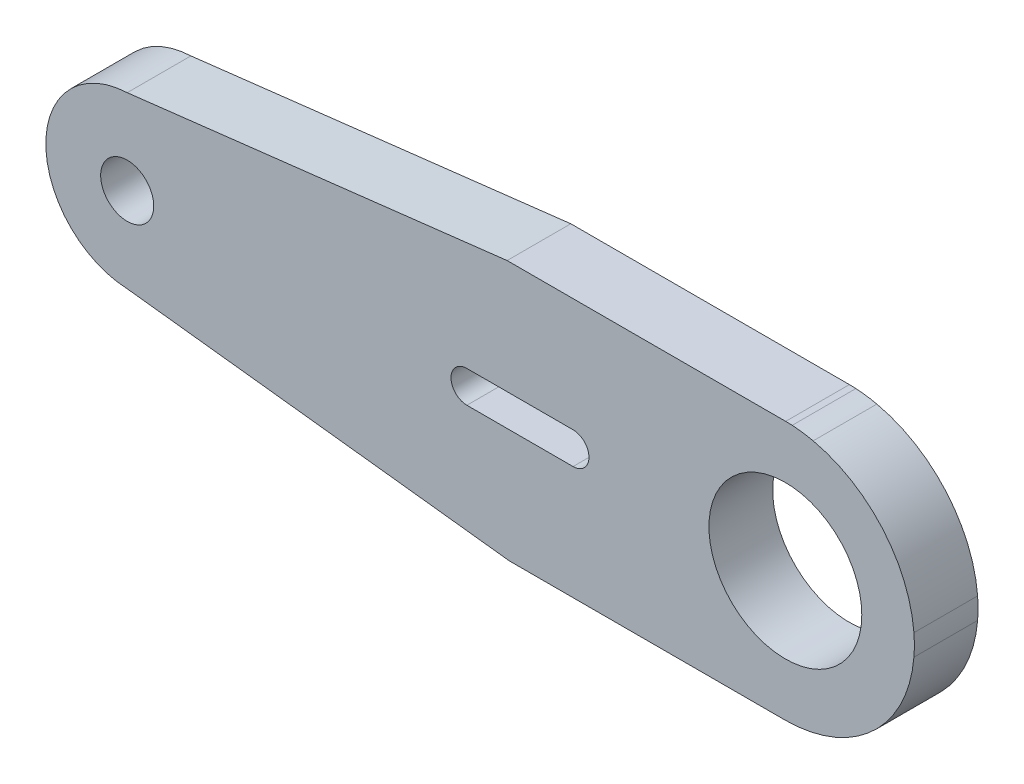
ISO-10303-21;
HEADER;
FILE_DESCRIPTION(('STEP AP214'),'2;1');
FILE_NAME('part.step','',(''),(''),'','','');
FILE_SCHEMA(('AUTOMOTIVE_DESIGN { 1 0 10303 214 1 1 1 1 }'));
ENDSEC;
DATA;
#1=APPLICATION_CONTEXT('core data for automotive mechanical design processes');
#2=APPLICATION_PROTOCOL_DEFINITION('international standard','automotive_design',2000,#1);
#3=PRODUCT_CONTEXT('',#1,'mechanical');
#4=PRODUCT('Part','Part','',(#3));
#5=PRODUCT_RELATED_PRODUCT_CATEGORY('part','',(#4));
#6=PRODUCT_DEFINITION_FORMATION('','',#4);
#7=PRODUCT_DEFINITION_CONTEXT('part definition',#1,'design');
#8=PRODUCT_DEFINITION('design','',#6,#7);
#9=PRODUCT_DEFINITION_SHAPE('','',#8);
#10=(LENGTH_UNIT() NAMED_UNIT(*) SI_UNIT(.MILLI.,.METRE.));
#11=(NAMED_UNIT(*) PLANE_ANGLE_UNIT() SI_UNIT($,.RADIAN.));
#12=(NAMED_UNIT(*) SI_UNIT($,.STERADIAN.) SOLID_ANGLE_UNIT());
#13=UNCERTAINTY_MEASURE_WITH_UNIT(LENGTH_MEASURE(1.E-05),#10,'distance_accuracy_value','');
#14=(GEOMETRIC_REPRESENTATION_CONTEXT(3) GLOBAL_UNCERTAINTY_ASSIGNED_CONTEXT((#13)) GLOBAL_UNIT_ASSIGNED_CONTEXT((#10,
#11,#12)) REPRESENTATION_CONTEXT('',''));
#15=CARTESIAN_POINT('',(0.,0.,0.));
#16=DIRECTION('',(0.,0.,1.));
#17=DIRECTION('',(1.,0.,0.));
#18=AXIS2_PLACEMENT_3D('',#15,#16,#17);
#19=CARTESIAN_POINT('',(2425.33996857822,1556.18845057078,3.));
#20=DIRECTION('',(0.,0.,-1.));
#21=DIRECTION('',(-1.,0.,0.));
#22=AXIS2_PLACEMENT_3D('',#19,#20,#21);
#23=CYLINDRICAL_SURFACE('',#22,6.09938036991776);
#24=CARTESIAN_POINT('',(2425.33996857822,1556.18845057078,0.));
#25=DIRECTION('',(0.,0.,1.));
#26=DIRECTION('',(1.,0.,0.));
#27=AXIS2_PLACEMENT_3D('',#24,#25,#26);
#28=CIRCLE('',#27,6.09938036991776);
#29=CARTESIAN_POINT('',(2426.67472444454,1562.13999387267,0.));
#30=VERTEX_POINT('',#29);
#31=CARTESIAN_POINT('',(2425.68542869963,1562.27803990024,0.));
#32=VERTEX_POINT('',#31);
#33=EDGE_CURVE('E206',#30,#32,#28,.T.);
#34=ORIENTED_EDGE('',*,*,#33,.T.);
#35=DIRECTION('',(0.,0.,-1.));
#36=VECTOR('',#35,1.);
#37=CARTESIAN_POINT('',(2425.68542869963,1562.27803990024,3.));
#38=LINE('',#37,#36);
#39=CARTESIAN_POINT('',(2425.68542869963,1562.27803990024,3.));
#40=VERTEX_POINT('',#39);
#41=EDGE_CURVE('E11',#40,#32,#38,.T.);
#42=ORIENTED_EDGE('',*,*,#41,.F.);
#43=CARTESIAN_POINT('',(2425.33996857822,1556.18845057078,3.));
#44=DIRECTION('',(0.,0.,1.));
#45=DIRECTION('',(1.,0.,0.));
#46=AXIS2_PLACEMENT_3D('',#43,#44,#45);
#47=CIRCLE('',#46,6.09938036991776);
#48=CARTESIAN_POINT('',(2426.67472444454,1562.13999387267,3.));
#49=VERTEX_POINT('',#48);
#50=EDGE_CURVE('E293',#49,#40,#47,.T.);
#51=ORIENTED_EDGE('',*,*,#50,.F.);
#52=DIRECTION('',(0.,0.,-1.));
#53=VECTOR('',#52,1.);
#54=CARTESIAN_POINT('',(2426.67472444454,1562.13999387267,3.));
#55=LINE('',#54,#53);
#56=EDGE_CURVE('E235',#49,#30,#55,.T.);
#57=ORIENTED_EDGE('',*,*,#56,.T.);
#58=EDGE_LOOP('',(#34,#42,#51,#57));
#59=FACE_BOUND('',#58,.T.);
#60=ADVANCED_FACE('F41',(#59),#23,.T.);
#61=CARTESIAN_POINT('',(2425.33982349252,1556.18741082578,3.));
#62=DIRECTION('',(0.,0.,-1.));
#63=DIRECTION('',(-1.,0.,0.));
#64=AXIS2_PLACEMENT_3D('',#61,#62,#63);
#65=CYLINDRICAL_SURFACE('',#64,6.10042666391895);
#66=CARTESIAN_POINT('',(2425.33982349252,1556.18741082578,0.));
#67=DIRECTION('',(0.,0.,1.));
#68=DIRECTION('',(1.,0.,0.));
#69=AXIS2_PLACEMENT_3D('',#66,#67,#68);
#70=CIRCLE('',#69,6.10042666391895);
#71=CARTESIAN_POINT('',(2425.38008449668,1562.28770463292,0.));
#72=VERTEX_POINT('',#71);
#73=EDGE_CURVE('E210',#32,#72,#70,.T.);
#74=ORIENTED_EDGE('',*,*,#73,.T.);
#75=DIRECTION('',(0.,0.,-1.));
#76=VECTOR('',#75,1.);
#77=CARTESIAN_POINT('',(2425.38008449668,1562.28770463292,3.));
#78=LINE('',#77,#76);
#79=CARTESIAN_POINT('',(2425.38008449668,1562.28770463292,3.));
#80=VERTEX_POINT('',#79);
#81=EDGE_CURVE('E52',#80,#72,#78,.T.);
#82=ORIENTED_EDGE('',*,*,#81,.F.);
#83=CARTESIAN_POINT('',(2425.33982349252,1556.18741082578,3.));
#84=DIRECTION('',(0.,0.,1.));
#85=DIRECTION('',(1.,0.,0.));
#86=AXIS2_PLACEMENT_3D('',#83,#84,#85);
#87=CIRCLE('',#86,6.10042666391895);
#88=EDGE_CURVE('E303',#40,#80,#87,.T.);
#89=ORIENTED_EDGE('',*,*,#88,.F.);
#90=ORIENTED_EDGE('',*,*,#41,.T.);
#91=EDGE_LOOP('',(#74,#82,#89,#90));
#92=FACE_BOUND('',#91,.T.);
#93=ADVANCED_FACE('F347',(#92),#65,.T.);
#94=CARTESIAN_POINT('',(-0.0796227058312107,1562.16408018961,3.));
#95=DIRECTION('',(5.0969489528988E-05,-0.999999998701055,0.));
#96=DIRECTION('',(0.999999998701056,5.0969489528988E-05,0.));
#97=AXIS2_PLACEMENT_3D('',#94,#95,#96);
#98=PLANE('',#97);
#99=DIRECTION('',(-0.999999998701056,-5.0969489528988E-05,0.));
#100=VECTOR('',#99,1.);
#101=CARTESIAN_POINT('',(-0.0796227058312107,1562.16408018961,0.));
#102=LINE('',#101,#100);
#103=CARTESIAN_POINT('',(2412.25909707203,1562.28703586288,0.));
#104=VERTEX_POINT('',#103);
#105=EDGE_CURVE('E213',#72,#104,#102,.T.);
#106=ORIENTED_EDGE('',*,*,#105,.T.);
#107=DIRECTION('',(0.,0.,-1.));
#108=VECTOR('',#107,1.);
#109=CARTESIAN_POINT('',(2412.25909707203,1562.28703586288,3.));
#110=LINE('',#109,#108);
#111=CARTESIAN_POINT('',(2412.25909707203,1562.28703586288,3.));
#112=VERTEX_POINT('',#111);
#113=EDGE_CURVE('E254',#112,#104,#110,.T.);
#114=ORIENTED_EDGE('',*,*,#113,.F.);
#115=DIRECTION('',(-0.999999998701056,-5.0969489528988E-05,0.));
#116=VECTOR('',#115,1.);
#117=CARTESIAN_POINT('',(-0.0796227058312107,1562.16408018961,3.));
#118=LINE('',#117,#116);
#119=EDGE_CURVE('E306',#80,#112,#118,.T.);
#120=ORIENTED_EDGE('',*,*,#119,.F.);
#121=ORIENTED_EDGE('',*,*,#81,.T.);
#122=EDGE_LOOP('',(#106,#114,#120,#121));
#123=FACE_BOUND('',#122,.T.);
#124=ADVANCED_FACE('F352',(#123),#98,.F.);
#125=CARTESIAN_POINT('',(-148.082953154036,1261.8119938318,3.));
#126=DIRECTION('',(0.116557468865907,-0.993183948949827,0.));
#127=DIRECTION('',(0.993183948949827,0.116557468865907,0.));
#128=AXIS2_PLACEMENT_3D('',#125,#126,#127);
#129=PLANE('',#128);
#130=DIRECTION('',(-0.993183948949827,-0.116557468865907,0.));
#131=VECTOR('',#130,1.);
#132=CARTESIAN_POINT('',(-148.082953154036,1261.8119938318,0.));
#133=LINE('',#132,#131);
#134=CARTESIAN_POINT('',(2394.36503748847,1560.18703586288,0.));
#135=VERTEX_POINT('',#134);
#136=EDGE_CURVE('E216',#104,#135,#133,.T.);
#137=ORIENTED_EDGE('',*,*,#136,.T.);
#138=DIRECTION('',(0.,0.,-1.));
#139=VECTOR('',#138,1.);
#140=CARTESIAN_POINT('',(2394.36503748847,1560.18703586288,3.));
#141=LINE('',#140,#139);
#142=CARTESIAN_POINT('',(2394.36503748847,1560.18703586288,3.));
#143=VERTEX_POINT('',#142);
#144=EDGE_CURVE('E250',#143,#135,#141,.T.);
#145=ORIENTED_EDGE('',*,*,#144,.F.);
#146=DIRECTION('',(-0.993183948949827,-0.116557468865907,0.));
#147=VECTOR('',#146,1.);
#148=CARTESIAN_POINT('',(-148.082953154036,1261.8119938318,3.));
#149=LINE('',#148,#147);
#150=EDGE_CURVE('E309',#112,#143,#149,.T.);
#151=ORIENTED_EDGE('',*,*,#150,.F.);
#152=ORIENTED_EDGE('',*,*,#113,.T.);
#153=EDGE_LOOP('',(#137,#145,#151,#152));
#154=FACE_BOUND('',#153,.T.);
#155=ADVANCED_FACE('F465',(#154),#129,.F.);
#156=CARTESIAN_POINT('',(2394.53674225824,1556.18703586288,3.));
#157=DIRECTION('',(0.,0.,-1.));
#158=DIRECTION('',(-1.,0.,0.));
#159=AXIS2_PLACEMENT_3D('',#156,#157,#158);
#160=CYLINDRICAL_SURFACE('',#159,4.00368361986295);
#161=CARTESIAN_POINT('',(2394.53674225824,1556.18703586288,0.));
#162=DIRECTION('',(0.,0.,1.));
#163=DIRECTION('',(1.,0.,0.));
#164=AXIS2_PLACEMENT_3D('',#161,#162,#163);
#165=CIRCLE('',#164,4.00368361986295);
#166=CARTESIAN_POINT('',(2394.36503748848,1552.18703586288,0.));
#167=VERTEX_POINT('',#166);
#168=EDGE_CURVE('E219',#135,#167,#165,.T.);
#169=ORIENTED_EDGE('',*,*,#168,.T.);
#170=DIRECTION('',(0.,0.,-1.));
#171=VECTOR('',#170,1.);
#172=CARTESIAN_POINT('',(2394.36503748848,1552.18703586288,3.));
#173=LINE('',#172,#171);
#174=CARTESIAN_POINT('',(2394.36503748848,1552.18703586288,3.));
#175=VERTEX_POINT('',#174);
#176=EDGE_CURVE('E246',#175,#167,#173,.T.);
#177=ORIENTED_EDGE('',*,*,#176,.F.);
#178=CARTESIAN_POINT('',(2394.53674225824,1556.18703586288,3.));
#179=DIRECTION('',(0.,0.,1.));
#180=DIRECTION('',(1.,0.,0.));
#181=AXIS2_PLACEMENT_3D('',#178,#179,#180);
#182=CIRCLE('',#181,4.00368361986295);
#183=EDGE_CURVE('E312',#143,#175,#182,.T.);
#184=ORIENTED_EDGE('',*,*,#183,.F.);
#185=ORIENTED_EDGE('',*,*,#144,.T.);
#186=EDGE_LOOP('',(#169,#177,#184,#185));
#187=FACE_BOUND('',#186,.T.);
#188=ADVANCED_FACE('F455',(#187),#160,.T.);
#189=CARTESIAN_POINT('',(210.810406910163,1806.93646851023,3.));
#190=DIRECTION('',(0.115881324440692,0.993263066184317,0.));
#191=DIRECTION('',(-0.993263066184317,0.115881324440692,0.));
#192=AXIS2_PLACEMENT_3D('',#189,#190,#191);
#193=PLANE('',#192);
#194=DIRECTION('',(0.993263066184317,-0.115881324440692,0.));
#195=VECTOR('',#194,1.);
#196=CARTESIAN_POINT('',(210.810406910163,1806.93646851023,0.));
#197=LINE('',#196,#195);
#198=CARTESIAN_POINT('',(2412.36493910381,1550.08703586288,0.));
#199=VERTEX_POINT('',#198);
#200=EDGE_CURVE('E222',#167,#199,#197,.T.);
#201=ORIENTED_EDGE('',*,*,#200,.T.);
#202=DIRECTION('',(0.,0.,-1.));
#203=VECTOR('',#202,1.);
#204=CARTESIAN_POINT('',(2412.36493910381,1550.08703586288,3.));
#205=LINE('',#204,#203);
#206=CARTESIAN_POINT('',(2412.36493910381,1550.08703586288,3.));
#207=VERTEX_POINT('',#206);
#208=EDGE_CURVE('E242',#207,#199,#205,.T.);
#209=ORIENTED_EDGE('',*,*,#208,.F.);
#210=DIRECTION('',(0.993263066184317,-0.115881324440692,0.));
#211=VECTOR('',#210,1.);
#212=CARTESIAN_POINT('',(210.810406910163,1806.93646851023,3.));
#213=LINE('',#212,#211);
#214=EDGE_CURVE('E315',#175,#207,#213,.T.);
#215=ORIENTED_EDGE('',*,*,#214,.F.);
#216=ORIENTED_EDGE('',*,*,#176,.T.);
#217=EDGE_LOOP('',(#201,#209,#215,#216));
#218=FACE_BOUND('',#217,.T.);
#219=ADVANCED_FACE('F323',(#218),#193,.F.);
#220=CARTESIAN_POINT('',(0.,1550.08703586288,3.));
#221=DIRECTION('',(0.,1.,0.));
#222=DIRECTION('',(0.,0.,1.));
#223=AXIS2_PLACEMENT_3D('',#220,#221,#222);
#224=PLANE('',#223);
#225=DIRECTION('',(1.,0.,0.));
#226=VECTOR('',#225,1.);
#227=CARTESIAN_POINT('',(0.,1550.08703586288,0.));
#228=LINE('',#227,#226);
#229=CARTESIAN_POINT('',(2425.3649391039,1550.08703586288,0.));
#230=VERTEX_POINT('',#229);
#231=EDGE_CURVE('E225',#199,#230,#228,.T.);
#232=ORIENTED_EDGE('',*,*,#231,.T.);
#233=DIRECTION('',(0.,0.,-1.));
#234=VECTOR('',#233,1.);
#235=CARTESIAN_POINT('',(2425.3649391039,1550.08703586288,3.));
#236=LINE('',#235,#234);
#237=CARTESIAN_POINT('',(2425.3649391039,1550.08703586288,3.));
#238=VERTEX_POINT('',#237);
#239=EDGE_CURVE('E171',#238,#230,#236,.T.);
#240=ORIENTED_EDGE('',*,*,#239,.F.);
#241=DIRECTION('',(1.,0.,0.));
#242=VECTOR('',#241,1.);
#243=CARTESIAN_POINT('',(0.,1550.08703586288,3.));
#244=LINE('',#243,#242);
#245=EDGE_CURVE('E160',#207,#238,#244,.T.);
#246=ORIENTED_EDGE('',*,*,#245,.F.);
#247=ORIENTED_EDGE('',*,*,#208,.T.);
#248=EDGE_LOOP('',(#232,#240,#246,#247));
#249=FACE_BOUND('',#248,.T.);
#250=ADVANCED_FACE('F327',(#249),#224,.F.);
#251=CARTESIAN_POINT('',(2425.33982349252,1556.18741082578,3.));
#252=DIRECTION('',(0.,0.,-1.));
#253=DIRECTION('',(-1.,0.,0.));
#254=AXIS2_PLACEMENT_3D('',#251,#252,#253);
#255=CYLINDRICAL_SURFACE('',#254,6.10042666391874);
#256=CARTESIAN_POINT('',(2425.33982349252,1556.18741082578,0.));
#257=DIRECTION('',(0.,0.,1.));
#258=DIRECTION('',(1.,0.,0.));
#259=AXIS2_PLACEMENT_3D('',#256,#257,#258);
#260=CIRCLE('',#259,6.10042666391874);
#261=CARTESIAN_POINT('',(2431.41977125444,1555.6879704448,0.));
#262=VERTEX_POINT('',#261);
#263=EDGE_CURVE('E169',#230,#262,#260,.T.);
#264=ORIENTED_EDGE('',*,*,#263,.T.);
#265=DIRECTION('',(0.,0.,-1.));
#266=VECTOR('',#265,1.);
#267=CARTESIAN_POINT('',(2431.41977125444,1555.6879704448,3.));
#268=LINE('',#267,#266);
#269=CARTESIAN_POINT('',(2431.41977125444,1555.6879704448,3.));
#270=VERTEX_POINT('',#269);
#271=EDGE_CURVE('E166',#270,#262,#268,.T.);
#272=ORIENTED_EDGE('',*,*,#271,.F.);
#273=CARTESIAN_POINT('',(2425.33982349252,1556.18741082578,3.));
#274=DIRECTION('',(0.,0.,1.));
#275=DIRECTION('',(1.,0.,0.));
#276=AXIS2_PLACEMENT_3D('',#273,#274,#275);
#277=CIRCLE('',#276,6.10042666391874);
#278=EDGE_CURVE('E154',#238,#270,#277,.T.);
#279=ORIENTED_EDGE('',*,*,#278,.F.);
#280=ORIENTED_EDGE('',*,*,#239,.T.);
#281=EDGE_LOOP('',(#264,#272,#279,#280));
#282=FACE_BOUND('',#281,.T.);
#283=ADVANCED_FACE('F167',(#282),#255,.T.);
#284=CARTESIAN_POINT('',(2425.36490256972,1556.18741082578,3.));
#285=DIRECTION('',(0.,0.,-1.));
#286=DIRECTION('',(-1.,0.,0.));
#287=AXIS2_PLACEMENT_3D('',#284,#285,#286);
#288=CYLINDRICAL_SURFACE('',#287,6.07543212317653);
#289=CARTESIAN_POINT('',(2425.36490256972,1556.18741082578,0.));
#290=DIRECTION('',(0.,0.,1.));
#291=DIRECTION('',(1.,0.,0.));
#292=AXIS2_PLACEMENT_3D('',#289,#290,#291);
#293=CIRCLE('',#292,6.07543212317653);
#294=CARTESIAN_POINT('',(2431.41977125444,1556.68685120676,0.));
#295=VERTEX_POINT('',#294);
#296=EDGE_CURVE('E108',#262,#295,#293,.T.);
#297=ORIENTED_EDGE('',*,*,#296,.T.);
#298=DIRECTION('',(0.,0.,-1.));
#299=VECTOR('',#298,1.);
#300=CARTESIAN_POINT('',(2431.41977125444,1556.68685120676,3.));
#301=LINE('',#300,#299);
#302=CARTESIAN_POINT('',(2431.41977125444,1556.68685120676,3.));
#303=VERTEX_POINT('',#302);
#304=EDGE_CURVE('E172',#303,#295,#301,.T.);
#305=ORIENTED_EDGE('',*,*,#304,.F.);
#306=CARTESIAN_POINT('',(2425.36490256972,1556.18741082578,3.));
#307=DIRECTION('',(0.,0.,1.));
#308=DIRECTION('',(1.,0.,0.));
#309=AXIS2_PLACEMENT_3D('',#306,#307,#308);
#310=CIRCLE('',#309,6.07543212317653);
#311=EDGE_CURVE('E158',#270,#303,#310,.T.);
#312=ORIENTED_EDGE('',*,*,#311,.F.);
#313=ORIENTED_EDGE('',*,*,#271,.T.);
#314=EDGE_LOOP('',(#297,#305,#312,#313));
#315=FACE_BOUND('',#314,.T.);
#316=ADVANCED_FACE('F174',(#315),#288,.T.);
#317=CARTESIAN_POINT('',(2410.36490479031,1556.18703586288,3.));
#318=DIRECTION('',(0.,0.,-1.));
#319=DIRECTION('',(-1.,0.,0.));
#320=AXIS2_PLACEMENT_3D('',#317,#318,#319);
#321=CYLINDRICAL_SURFACE('',#320,0.750000000000241);
#322=CARTESIAN_POINT('',(2410.36490479031,1556.18703586288,0.));
#323=DIRECTION('',(0.,0.,1.));
#324=DIRECTION('',(1.,0.,0.));
#325=AXIS2_PLACEMENT_3D('',#322,#323,#324);
#326=CIRCLE('',#325,0.750000000000241);
#327=CARTESIAN_POINT('',(2410.36496073506,1556.9370358608,0.));
#328=VERTEX_POINT('',#327);
#329=CARTESIAN_POINT('',(2410.36496073506,1555.43703586497,0.));
#330=VERTEX_POINT('',#329);
#331=EDGE_CURVE('E190',#328,#330,#326,.T.);
#332=ORIENTED_EDGE('',*,*,#331,.F.);
#333=DIRECTION('',(0.,0.,-1.));
#334=VECTOR('',#333,1.);
#335=CARTESIAN_POINT('',(2410.36496073506,1556.9370358608,3.));
#336=LINE('',#335,#334);
#337=CARTESIAN_POINT('',(2410.36496073506,1556.9370358608,3.));
#338=VERTEX_POINT('',#337);
#339=EDGE_CURVE('E45',#338,#328,#336,.T.);
#340=ORIENTED_EDGE('',*,*,#339,.F.);
#341=CARTESIAN_POINT('',(2410.36490479031,1556.18703586288,3.));
#342=DIRECTION('',(0.,0.,1.));
#343=DIRECTION('',(1.,0.,0.));
#344=AXIS2_PLACEMENT_3D('',#341,#342,#343);
#345=CIRCLE('',#344,0.750000000000241);
#346=CARTESIAN_POINT('',(2410.36496073506,1555.43703586497,3.));
#347=VERTEX_POINT('',#346);
#348=EDGE_CURVE('E283',#338,#347,#345,.T.);
#349=ORIENTED_EDGE('',*,*,#348,.T.);
#350=DIRECTION('',(0.,0.,-1.));
#351=VECTOR('',#350,1.);
#352=CARTESIAN_POINT('',(2410.36496073506,1555.43703586497,3.));
#353=LINE('',#352,#351);
#354=EDGE_CURVE('E178',#347,#330,#353,.T.);
#355=ORIENTED_EDGE('',*,*,#354,.T.);
#356=EDGE_LOOP('',(#332,#340,#349,#355));
#357=FACE_BOUND('',#356,.T.);
#358=ADVANCED_FACE('F281',(#357),#321,.F.);
#359=CARTESIAN_POINT('',(5.18219152778422E-07,1556.93703666308,3.));
#360=DIRECTION('',(3.32845285695754E-10,1.,0.));
#361=DIRECTION('',(-1.,3.32845285695754E-10,0.));
#362=AXIS2_PLACEMENT_3D('',#359,#360,#361);
#363=PLANE('',#362);
#364=DIRECTION('',(1.,-3.32845285695754E-10,0.));
#365=VECTOR('',#364,1.);
#366=CARTESIAN_POINT('',(5.18219152778422E-07,1556.93703666308,0.));
#367=LINE('',#366,#365);
#368=CARTESIAN_POINT('',(2415.36495438206,1556.93703585913,0.));
#369=VERTEX_POINT('',#368);
#370=EDGE_CURVE('E194',#328,#369,#367,.T.);
#371=ORIENTED_EDGE('',*,*,#370,.T.);
#372=DIRECTION('',(0.,0.,-1.));
#373=VECTOR('',#372,1.);
#374=CARTESIAN_POINT('',(2415.36495438206,1556.93703585913,3.));
#375=LINE('',#374,#373);
#376=CARTESIAN_POINT('',(2415.36495438206,1556.93703585913,3.));
#377=VERTEX_POINT('',#376);
#378=EDGE_CURVE('E265',#377,#369,#375,.T.);
#379=ORIENTED_EDGE('',*,*,#378,.F.);
#380=DIRECTION('',(1.,-3.32845285695754E-10,0.));
#381=VECTOR('',#380,1.);
#382=CARTESIAN_POINT('',(5.18219152778422E-07,1556.93703666308,3.));
#383=LINE('',#382,#381);
#384=EDGE_CURVE('E275',#338,#377,#383,.T.);
#385=ORIENTED_EDGE('',*,*,#384,.F.);
#386=ORIENTED_EDGE('',*,*,#339,.T.);
#387=EDGE_LOOP('',(#371,#379,#385,#386));
#388=FACE_BOUND('',#387,.T.);
#389=ADVANCED_FACE('F274',(#388),#363,.F.);
#390=CARTESIAN_POINT('',(2415.36487937831,1556.18703586288,3.));
#391=DIRECTION('',(0.,0.,-1.));
#392=DIRECTION('',(-1.,0.,0.));
#393=AXIS2_PLACEMENT_3D('',#390,#391,#392);
#394=CYLINDRICAL_SURFACE('',#393,0.750000000000403);
#395=CARTESIAN_POINT('',(2415.36487937831,1556.18703586288,0.));
#396=DIRECTION('',(0.,0.,1.));
#397=DIRECTION('',(1.,0.,0.));
#398=AXIS2_PLACEMENT_3D('',#395,#396,#397);
#399=CIRCLE('',#398,0.750000000000403);
#400=CARTESIAN_POINT('',(2415.36495438206,1555.43703586663,0.));
#401=VERTEX_POINT('',#400);
#402=EDGE_CURVE('E198',#401,#369,#399,.T.);
#403=ORIENTED_EDGE('',*,*,#402,.F.);
#404=DIRECTION('',(0.,0.,-1.));
#405=VECTOR('',#404,1.);
#406=CARTESIAN_POINT('',(2415.36495438206,1555.43703586663,3.));
#407=LINE('',#406,#405);
#408=CARTESIAN_POINT('',(2415.36495438206,1555.43703586663,3.));
#409=VERTEX_POINT('',#408);
#410=EDGE_CURVE('E263',#409,#401,#407,.T.);
#411=ORIENTED_EDGE('',*,*,#410,.F.);
#412=CARTESIAN_POINT('',(2415.36487937831,1556.18703586288,3.));
#413=DIRECTION('',(0.,0.,1.));
#414=DIRECTION('',(1.,0.,0.));
#415=AXIS2_PLACEMENT_3D('',#412,#413,#414);
#416=CIRCLE('',#415,0.750000000000403);
#417=EDGE_CURVE('E289',#409,#377,#416,.T.);
#418=ORIENTED_EDGE('',*,*,#417,.T.);
#419=ORIENTED_EDGE('',*,*,#378,.T.);
#420=EDGE_LOOP('',(#403,#411,#418,#419));
#421=FACE_BOUND('',#420,.T.);
#422=ADVANCED_FACE('F287',(#421),#394,.F.);
#423=CARTESIAN_POINT('',(-5.17374507476788E-07,1555.43703506323,3.));
#424=DIRECTION('',(3.32623240808817E-10,-1.,0.));
#425=DIRECTION('',(1.,3.32623240808817E-10,0.));
#426=AXIS2_PLACEMENT_3D('',#423,#424,#425);
#427=PLANE('',#426);
#428=DIRECTION('',(-1.,-3.32623240808817E-10,0.));
#429=VECTOR('',#428,1.);
#430=CARTESIAN_POINT('',(-5.17374507476788E-07,1555.43703506323,0.));
#431=LINE('',#430,#429);
#432=EDGE_CURVE('E202',#401,#330,#431,.T.);
#433=ORIENTED_EDGE('',*,*,#432,.T.);
#434=ORIENTED_EDGE('',*,*,#354,.F.);
#435=DIRECTION('',(-1.,-3.32623240808817E-10,0.));
#436=VECTOR('',#435,1.);
#437=CARTESIAN_POINT('',(-5.17374507476788E-07,1555.43703506323,3.));
#438=LINE('',#437,#436);
#439=EDGE_CURVE('E290',#409,#347,#438,.T.);
#440=ORIENTED_EDGE('',*,*,#439,.F.);
#441=ORIENTED_EDGE('',*,*,#410,.T.);
#442=EDGE_LOOP('',(#433,#434,#440,#441));
#443=FACE_BOUND('',#442,.T.);
#444=ADVANCED_FACE('F286',(#443),#427,.F.);
#445=CARTESIAN_POINT('',(2394.36503748848,1556.18703586288,3.));
#446=DIRECTION('',(0.,0.,-1.));
#447=DIRECTION('',(-1.,0.,0.));
#448=AXIS2_PLACEMENT_3D('',#445,#446,#447);
#449=CYLINDRICAL_SURFACE('',#448,1.25000000000008);
#450=CARTESIAN_POINT('',(2394.36503748848,1556.18703586288,3.));
#451=DIRECTION('',(0.,0.,1.));
#452=DIRECTION('',(1.,0.,0.));
#453=AXIS2_PLACEMENT_3D('',#450,#451,#452);
#454=CIRCLE('',#453,1.25000000000008);
#455=CARTESIAN_POINT('',(2395.61503748848,1556.18703586288,3.));
#456=VERTEX_POINT('',#455);
#457=EDGE_CURVE('E371',#456,#456,#454,.T.);
#458=ORIENTED_EDGE('',*,*,#457,.T.);
#459=EDGE_LOOP('',(#458));
#460=FACE_BOUND('',#459,.T.);
#461=CARTESIAN_POINT('',(2394.36503748848,1556.18703586288,0.));
#462=DIRECTION('',(0.,0.,1.));
#463=DIRECTION('',(1.,0.,0.));
#464=AXIS2_PLACEMENT_3D('',#461,#462,#463);
#465=CIRCLE('',#464,1.25000000000008);
#466=CARTESIAN_POINT('',(2395.61503748848,1556.18703586288,0.));
#467=VERTEX_POINT('',#466);
#468=EDGE_CURVE('E186',#467,#467,#465,.T.);
#469=ORIENTED_EDGE('',*,*,#468,.F.);
#470=EDGE_LOOP('',(#469));
#471=FACE_BOUND('',#470,.T.);
#472=ADVANCED_FACE('F342',(#460,#471),#449,.F.);
#473=CARTESIAN_POINT('',(2425.36492938331,1556.18708586288,3.));
#474=DIRECTION('',(0.,0.,-1.));
#475=DIRECTION('',(-1.,0.,0.));
#476=AXIS2_PLACEMENT_3D('',#473,#474,#475);
#477=CYLINDRICAL_SURFACE('',#476,3.60000000000003);
#478=CARTESIAN_POINT('',(2425.36492938331,1556.18708586288,3.));
#479=DIRECTION('',(0.,0.,1.));
#480=DIRECTION('',(1.,0.,0.));
#481=AXIS2_PLACEMENT_3D('',#478,#479,#480);
#482=CIRCLE('',#481,3.60000000000003);
#483=CARTESIAN_POINT('',(2428.96492938331,1556.18708586288,3.));
#484=VERTEX_POINT('',#483);
#485=EDGE_CURVE('E234',#484,#484,#482,.T.);
#486=ORIENTED_EDGE('',*,*,#485,.T.);
#487=EDGE_LOOP('',(#486));
#488=FACE_BOUND('',#487,.T.);
#489=CARTESIAN_POINT('',(2425.36492938331,1556.18708586288,0.));
#490=DIRECTION('',(0.,0.,1.));
#491=DIRECTION('',(1.,0.,0.));
#492=AXIS2_PLACEMENT_3D('',#489,#490,#491);
#493=CIRCLE('',#492,3.60000000000003);
#494=CARTESIAN_POINT('',(2428.96492938331,1556.18708586288,0.));
#495=VERTEX_POINT('',#494);
#496=EDGE_CURVE('E182',#495,#495,#493,.T.);
#497=ORIENTED_EDGE('',*,*,#496,.F.);
#498=EDGE_LOOP('',(#497));
#499=FACE_BOUND('',#498,.T.);
#500=ADVANCED_FACE('F43',(#488,#499),#477,.F.);
#501=CARTESIAN_POINT('',(2425.33982349252,1556.18741082578,3.));
#502=DIRECTION('',(0.,0.,-1.));
#503=DIRECTION('',(-1.,0.,0.));
#504=AXIS2_PLACEMENT_3D('',#501,#502,#503);
#505=CYLINDRICAL_SURFACE('',#504,6.10042666391856);
#506=CARTESIAN_POINT('',(2425.33982349252,1556.18741082578,0.));
#507=DIRECTION('',(0.,0.,1.));
#508=DIRECTION('',(1.,0.,0.));
#509=AXIS2_PLACEMENT_3D('',#506,#507,#508);
#510=CIRCLE('',#509,6.10042666391856);
#511=EDGE_CURVE('E114',#295,#30,#510,.T.);
#512=ORIENTED_EDGE('',*,*,#511,.T.);
#513=ORIENTED_EDGE('',*,*,#56,.F.);
#514=CARTESIAN_POINT('',(2425.33982349252,1556.18741082578,3.));
#515=DIRECTION('',(0.,0.,1.));
#516=DIRECTION('',(1.,0.,0.));
#517=AXIS2_PLACEMENT_3D('',#514,#515,#516);
#518=CIRCLE('',#517,6.10042666391856);
#519=EDGE_CURVE('E61',#303,#49,#518,.T.);
#520=ORIENTED_EDGE('',*,*,#519,.F.);
#521=ORIENTED_EDGE('',*,*,#304,.T.);
#522=EDGE_LOOP('',(#512,#513,#520,#521));
#523=FACE_BOUND('',#522,.T.);
#524=ADVANCED_FACE('F333',(#523),#505,.T.);
#525=CARTESIAN_POINT('',(0.,0.,3.));
#526=DIRECTION('',(0.,0.,1.));
#527=DIRECTION('',(1.,0.,0.));
#528=AXIS2_PLACEMENT_3D('',#525,#526,#527);
#529=PLANE('',#528);
#530=ORIENTED_EDGE('',*,*,#485,.F.);
#531=EDGE_LOOP('',(#530));
#532=FACE_BOUND('',#531,.T.);
#533=ORIENTED_EDGE('',*,*,#457,.F.);
#534=EDGE_LOOP('',(#533));
#535=FACE_BOUND('',#534,.T.);
#536=ORIENTED_EDGE('',*,*,#348,.F.);
#537=ORIENTED_EDGE('',*,*,#384,.T.);
#538=ORIENTED_EDGE('',*,*,#417,.F.);
#539=ORIENTED_EDGE('',*,*,#439,.T.);
#540=EDGE_LOOP('',(#536,#537,#538,#539));
#541=FACE_BOUND('',#540,.T.);
#542=ORIENTED_EDGE('',*,*,#50,.T.);
#543=ORIENTED_EDGE('',*,*,#88,.T.);
#544=ORIENTED_EDGE('',*,*,#119,.T.);
#545=ORIENTED_EDGE('',*,*,#150,.T.);
#546=ORIENTED_EDGE('',*,*,#183,.T.);
#547=ORIENTED_EDGE('',*,*,#214,.T.);
#548=ORIENTED_EDGE('',*,*,#245,.T.);
#549=ORIENTED_EDGE('',*,*,#278,.T.);
#550=ORIENTED_EDGE('',*,*,#311,.T.);
#551=ORIENTED_EDGE('',*,*,#519,.T.);
#552=EDGE_LOOP('',(#542,#543,#544,#545,#546,#547,#548,#549,#550,#551));
#553=FACE_BOUND('',#552,.T.);
#554=ADVANCED_FACE('F156',(#532,#535,#541,#553),#529,.T.);
#555=CARTESIAN_POINT('',(0.,0.,0.));
#556=DIRECTION('',(0.,0.,1.));
#557=DIRECTION('',(1.,0.,0.));
#558=AXIS2_PLACEMENT_3D('',#555,#556,#557);
#559=PLANE('',#558);
#560=ORIENTED_EDGE('',*,*,#496,.T.);
#561=EDGE_LOOP('',(#560));
#562=FACE_BOUND('',#561,.T.);
#563=ORIENTED_EDGE('',*,*,#468,.T.);
#564=EDGE_LOOP('',(#563));
#565=FACE_BOUND('',#564,.T.);
#566=ORIENTED_EDGE('',*,*,#331,.T.);
#567=ORIENTED_EDGE('',*,*,#432,.F.);
#568=ORIENTED_EDGE('',*,*,#402,.T.);
#569=ORIENTED_EDGE('',*,*,#370,.F.);
#570=EDGE_LOOP('',(#566,#567,#568,#569));
#571=FACE_BOUND('',#570,.T.);
#572=ORIENTED_EDGE('',*,*,#33,.F.);
#573=ORIENTED_EDGE('',*,*,#511,.F.);
#574=ORIENTED_EDGE('',*,*,#296,.F.);
#575=ORIENTED_EDGE('',*,*,#263,.F.);
#576=ORIENTED_EDGE('',*,*,#231,.F.);
#577=ORIENTED_EDGE('',*,*,#200,.F.);
#578=ORIENTED_EDGE('',*,*,#168,.F.);
#579=ORIENTED_EDGE('',*,*,#136,.F.);
#580=ORIENTED_EDGE('',*,*,#105,.F.);
#581=ORIENTED_EDGE('',*,*,#73,.F.);
#582=EDGE_LOOP('',(#572,#573,#574,#575,#576,#577,#578,#579,#580,#581));
#583=FACE_BOUND('',#582,.T.);
#584=ADVANCED_FACE('F278',(#562,#565,#571,#583),#559,.F.);
#585=CLOSED_SHELL('',(#60,#93,#124,#155,#188,#219,#250,#283,#316,#358,#389,#422,#444,#472,#500,
#524,#554,#584));
#586=MANIFOLD_SOLID_BREP('B2',#585);
#587=ADVANCED_BREP_SHAPE_REPRESENTATION('',(#18,#586),#14);
#588=SHAPE_DEFINITION_REPRESENTATION(#9,#587);
ENDSEC;
END-ISO-10303-21;
